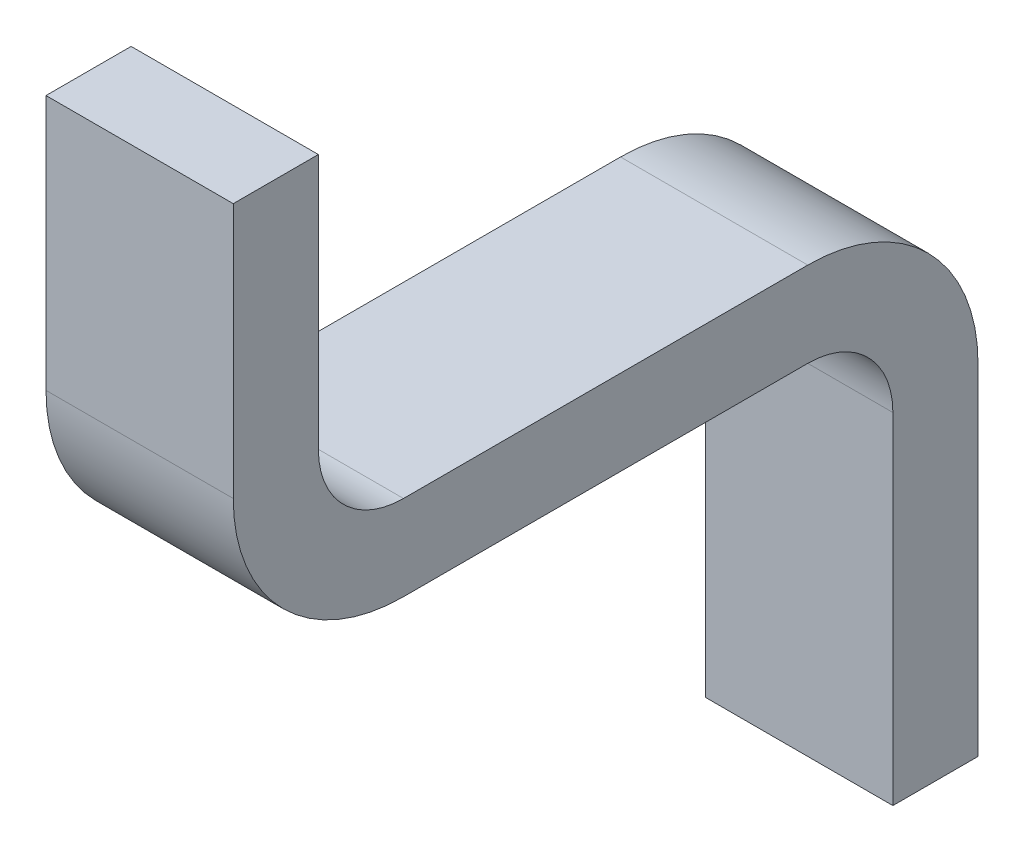
ISO-10303-21;
HEADER;
FILE_DESCRIPTION(('STEP AP214'),'2;1');
FILE_NAME('part.step','',(''),(''),'','','');
FILE_SCHEMA(('AUTOMOTIVE_DESIGN { 1 0 10303 214 1 1 1 1 }'));
ENDSEC;
DATA;
#1=APPLICATION_CONTEXT('core data for automotive mechanical design processes');
#2=APPLICATION_PROTOCOL_DEFINITION('international standard','automotive_design',2000,#1);
#3=PRODUCT_CONTEXT('',#1,'mechanical');
#4=PRODUCT('Part','Part','',(#3));
#5=PRODUCT_RELATED_PRODUCT_CATEGORY('part','',(#4));
#6=PRODUCT_DEFINITION_FORMATION('','',#4);
#7=PRODUCT_DEFINITION_CONTEXT('part definition',#1,'design');
#8=PRODUCT_DEFINITION('design','',#6,#7);
#9=PRODUCT_DEFINITION_SHAPE('','',#8);
#10=(LENGTH_UNIT() NAMED_UNIT(*) SI_UNIT(.MILLI.,.METRE.));
#11=(NAMED_UNIT(*) PLANE_ANGLE_UNIT() SI_UNIT($,.RADIAN.));
#12=(NAMED_UNIT(*) SI_UNIT($,.STERADIAN.) SOLID_ANGLE_UNIT());
#13=UNCERTAINTY_MEASURE_WITH_UNIT(LENGTH_MEASURE(1.E-05),#10,'distance_accuracy_value','');
#14=(GEOMETRIC_REPRESENTATION_CONTEXT(3) GLOBAL_UNCERTAINTY_ASSIGNED_CONTEXT((#13)) GLOBAL_UNIT_ASSIGNED_CONTEXT((#10,
#11,#12)) REPRESENTATION_CONTEXT('',''));
#15=CARTESIAN_POINT('',(0.,0.,0.));
#16=DIRECTION('',(0.,0.,1.));
#17=DIRECTION('',(1.,0.,0.));
#18=AXIS2_PLACEMENT_3D('',#15,#16,#17);
#19=CARTESIAN_POINT('',(-0.14,-3.9,0.675));
#20=DIRECTION('',(-1.,0.,0.));
#21=DIRECTION('',(0.,-1.,0.));
#22=AXIS2_PLACEMENT_3D('',#19,#20,#21);
#23=PLANE('',#22);
#24=CARTESIAN_POINT('',(-0.14,-3.8,0.675));
#25=DIRECTION('',(-1.,0.,0.));
#26=DIRECTION('',(0.,-1.,0.));
#27=AXIS2_PLACEMENT_3D('',#24,#25,#26);
#28=CIRCLE('',#27,0.1);
#29=CARTESIAN_POINT('',(-0.14,-3.9,0.675));
#30=VERTEX_POINT('',#29);
#31=CARTESIAN_POINT('',(-0.14,-3.8,0.775));
#32=VERTEX_POINT('',#31);
#33=EDGE_CURVE('E162',#30,#32,#28,.T.);
#34=ORIENTED_EDGE('',*,*,#33,.T.);
#35=DIRECTION('',(0.,1.,0.));
#36=VECTOR('',#35,1.);
#37=CARTESIAN_POINT('',(-0.14,-3.5,0.775));
#38=LINE('',#37,#36);
#39=CARTESIAN_POINT('',(-0.14,-3.5,0.775));
#40=VERTEX_POINT('',#39);
#41=EDGE_CURVE('E120',#32,#40,#38,.T.);
#42=ORIENTED_EDGE('',*,*,#41,.T.);
#43=DIRECTION('',(0.,0.,1.));
#44=VECTOR('',#43,1.);
#45=CARTESIAN_POINT('',(-0.14,-3.5,0.775));
#46=LINE('',#45,#44);
#47=CARTESIAN_POINT('',(-0.14,-3.5,0.875));
#48=VERTEX_POINT('',#47);
#49=EDGE_CURVE('E116',#48,#40,#46,.F.);
#50=ORIENTED_EDGE('',*,*,#49,.F.);
#51=DIRECTION('',(0.,1.,0.));
#52=VECTOR('',#51,1.);
#53=CARTESIAN_POINT('',(-0.14,-3.5,0.875));
#54=LINE('',#53,#52);
#55=CARTESIAN_POINT('',(-0.14,-3.8,0.875));
#56=VERTEX_POINT('',#55);
#57=EDGE_CURVE('E111',#48,#56,#54,.F.);
#58=ORIENTED_EDGE('',*,*,#57,.T.);
#59=CARTESIAN_POINT('',(-0.14,-3.8,0.675));
#60=DIRECTION('',(-1.,0.,0.));
#61=DIRECTION('',(0.,-1.,0.));
#62=AXIS2_PLACEMENT_3D('',#59,#60,#61);
#63=CIRCLE('',#62,0.2);
#64=CARTESIAN_POINT('',(-0.14,-4.,0.675));
#65=VERTEX_POINT('',#64);
#66=EDGE_CURVE('E102',#65,#56,#63,.T.);
#67=ORIENTED_EDGE('',*,*,#66,.F.);
#68=DIRECTION('',(0.,0.,1.));
#69=VECTOR('',#68,1.);
#70=CARTESIAN_POINT('',(-0.14,-4.,0.675));
#71=LINE('',#70,#69);
#72=CARTESIAN_POINT('',(-0.14,-4.,0.2));
#73=VERTEX_POINT('',#72);
#74=EDGE_CURVE('E98',#65,#73,#71,.F.);
#75=ORIENTED_EDGE('',*,*,#74,.T.);
#76=CARTESIAN_POINT('',(-0.14,-4.1,0.2));
#77=DIRECTION('',(1.,0.,0.));
#78=DIRECTION('',(0.,1.,0.));
#79=AXIS2_PLACEMENT_3D('',#76,#77,#78);
#80=CIRCLE('',#79,0.1);
#81=CARTESIAN_POINT('',(-0.14,-4.1,0.1));
#82=VERTEX_POINT('',#81);
#83=EDGE_CURVE('E20',#73,#82,#80,.F.);
#84=ORIENTED_EDGE('',*,*,#83,.T.);
#85=DIRECTION('',(0.,1.,0.));
#86=VECTOR('',#85,1.);
#87=CARTESIAN_POINT('',(-0.14,-4.1,0.1));
#88=LINE('',#87,#86);
#89=CARTESIAN_POINT('',(-0.14,-4.5,0.1));
#90=VERTEX_POINT('',#89);
#91=EDGE_CURVE('E145',#82,#90,#88,.F.);
#92=ORIENTED_EDGE('',*,*,#91,.T.);
#93=DIRECTION('',(0.,0.,1.));
#94=VECTOR('',#93,1.);
#95=CARTESIAN_POINT('',(-0.14,-4.5,0.));
#96=LINE('',#95,#94);
#97=CARTESIAN_POINT('',(-0.14,-4.5,0.));
#98=VERTEX_POINT('',#97);
#99=EDGE_CURVE('E139',#90,#98,#96,.F.);
#100=ORIENTED_EDGE('',*,*,#99,.T.);
#101=DIRECTION('',(0.,1.,0.));
#102=VECTOR('',#101,1.);
#103=CARTESIAN_POINT('',(-0.14,-4.1,0.));
#104=LINE('',#103,#102);
#105=CARTESIAN_POINT('',(-0.14,-4.1,0.));
#106=VERTEX_POINT('',#105);
#107=EDGE_CURVE('E132',#98,#106,#104,.T.);
#108=ORIENTED_EDGE('',*,*,#107,.T.);
#109=CARTESIAN_POINT('',(-0.14,-4.1,0.2));
#110=DIRECTION('',(1.,0.,0.));
#111=DIRECTION('',(0.,1.,0.));
#112=AXIS2_PLACEMENT_3D('',#109,#110,#111);
#113=CIRCLE('',#112,0.2);
#114=CARTESIAN_POINT('',(-0.14,-3.9,0.2));
#115=VERTEX_POINT('',#114);
#116=EDGE_CURVE('E135',#115,#106,#113,.F.);
#117=ORIENTED_EDGE('',*,*,#116,.F.);
#118=DIRECTION('',(0.,0.,1.));
#119=VECTOR('',#118,1.);
#120=CARTESIAN_POINT('',(-0.14,-3.9,0.675));
#121=LINE('',#120,#119);
#122=EDGE_CURVE('E128',#115,#30,#121,.T.);
#123=ORIENTED_EDGE('',*,*,#122,.T.);
#124=EDGE_LOOP('',(#34,#42,#50,#58,#67,#75,#84,#92,#100,#108,#117,#123));
#125=FACE_BOUND('',#124,.T.);
#126=ADVANCED_FACE('F17',(#125),#23,.F.);
#127=CARTESIAN_POINT('',(-0.14,-4.1,0.2));
#128=DIRECTION('',(1.,0.,0.));
#129=DIRECTION('',(0.,1.,0.));
#130=AXIS2_PLACEMENT_3D('',#127,#128,#129);
#131=CYLINDRICAL_SURFACE('',#130,0.1);
#132=DIRECTION('',(-1.,0.,0.));
#133=VECTOR('',#132,1.);
#134=CARTESIAN_POINT('',(-0.14,-4.,0.2));
#135=LINE('',#134,#133);
#136=CARTESIAN_POINT('',(-0.36,-4.,0.2));
#137=VERTEX_POINT('',#136);
#138=EDGE_CURVE('E91',#73,#137,#135,.T.);
#139=ORIENTED_EDGE('',*,*,#138,.T.);
#140=CARTESIAN_POINT('',(-0.36,-4.1,0.2));
#141=DIRECTION('',(1.,0.,0.));
#142=DIRECTION('',(0.,1.,0.));
#143=AXIS2_PLACEMENT_3D('',#140,#141,#142);
#144=CIRCLE('',#143,0.1);
#145=CARTESIAN_POINT('',(-0.36,-4.1,0.1));
#146=VERTEX_POINT('',#145);
#147=EDGE_CURVE('E103',#137,#146,#144,.F.);
#148=ORIENTED_EDGE('',*,*,#147,.T.);
#149=DIRECTION('',(-1.,0.,0.));
#150=VECTOR('',#149,1.);
#151=CARTESIAN_POINT('',(-0.14,-4.1,0.1));
#152=LINE('',#151,#150);
#153=EDGE_CURVE('E92',#146,#82,#152,.F.);
#154=ORIENTED_EDGE('',*,*,#153,.T.);
#155=ORIENTED_EDGE('',*,*,#83,.F.);
#156=EDGE_LOOP('',(#139,#148,#154,#155));
#157=FACE_BOUND('',#156,.T.);
#158=ADVANCED_FACE('F89',(#157),#131,.F.);
#159=CARTESIAN_POINT('',(-0.14,-4.1,0.1));
#160=DIRECTION('',(0.,0.,-1.));
#161=DIRECTION('',(-1.,0.,0.));
#162=AXIS2_PLACEMENT_3D('',#159,#160,#161);
#163=PLANE('',#162);
#164=ORIENTED_EDGE('',*,*,#153,.F.);
#165=DIRECTION('',(0.,1.,0.));
#166=VECTOR('',#165,1.);
#167=CARTESIAN_POINT('',(-0.36,-4.,0.1));
#168=LINE('',#167,#166);
#169=CARTESIAN_POINT('',(-0.36,-4.5,0.1));
#170=VERTEX_POINT('',#169);
#171=EDGE_CURVE('E105',#146,#170,#168,.F.);
#172=ORIENTED_EDGE('',*,*,#171,.T.);
#173=DIRECTION('',(-1.,0.,0.));
#174=VECTOR('',#173,1.);
#175=CARTESIAN_POINT('',(-0.36,-4.5,0.1));
#176=LINE('',#175,#174);
#177=EDGE_CURVE('E142',#170,#90,#176,.F.);
#178=ORIENTED_EDGE('',*,*,#177,.T.);
#179=ORIENTED_EDGE('',*,*,#91,.F.);
#180=EDGE_LOOP('',(#164,#172,#178,#179));
#181=FACE_BOUND('',#180,.T.);
#182=ADVANCED_FACE('F187',(#181),#163,.F.);
#183=CARTESIAN_POINT('',(-0.36,-4.5,0.));
#184=DIRECTION('',(0.,1.,0.));
#185=DIRECTION('',(-1.,0.,0.));
#186=AXIS2_PLACEMENT_3D('',#183,#184,#185);
#187=PLANE('',#186);
#188=ORIENTED_EDGE('',*,*,#177,.F.);
#189=DIRECTION('',(0.,0.,1.));
#190=VECTOR('',#189,1.);
#191=CARTESIAN_POINT('',(-0.36,-4.5,0.675));
#192=LINE('',#191,#190);
#193=CARTESIAN_POINT('',(-0.36,-4.5,0.));
#194=VERTEX_POINT('',#193);
#195=EDGE_CURVE('E176',#170,#194,#192,.F.);
#196=ORIENTED_EDGE('',*,*,#195,.T.);
#197=DIRECTION('',(1.,0.,0.));
#198=VECTOR('',#197,1.);
#199=CARTESIAN_POINT('',(-0.36,-4.5,0.));
#200=LINE('',#199,#198);
#201=EDGE_CURVE('E136',#194,#98,#200,.T.);
#202=ORIENTED_EDGE('',*,*,#201,.T.);
#203=ORIENTED_EDGE('',*,*,#99,.F.);
#204=EDGE_LOOP('',(#188,#196,#202,#203));
#205=FACE_BOUND('',#204,.T.);
#206=ADVANCED_FACE('F192',(#205),#187,.F.);
#207=CARTESIAN_POINT('',(-0.36,-4.1,0.));
#208=DIRECTION('',(0.,0.,1.));
#209=DIRECTION('',(1.,0.,0.));
#210=AXIS2_PLACEMENT_3D('',#207,#208,#209);
#211=PLANE('',#210);
#212=DIRECTION('',(1.,0.,0.));
#213=VECTOR('',#212,1.);
#214=CARTESIAN_POINT('',(-0.36,-4.1,0.));
#215=LINE('',#214,#213);
#216=CARTESIAN_POINT('',(-0.36,-4.1,0.));
#217=VERTEX_POINT('',#216);
#218=EDGE_CURVE('E163',#106,#217,#215,.F.);
#219=ORIENTED_EDGE('',*,*,#218,.F.);
#220=ORIENTED_EDGE('',*,*,#107,.F.);
#221=ORIENTED_EDGE('',*,*,#201,.F.);
#222=DIRECTION('',(0.,1.,0.));
#223=VECTOR('',#222,1.);
#224=CARTESIAN_POINT('',(-0.36,-4.,0.));
#225=LINE('',#224,#223);
#226=EDGE_CURVE('E159',#194,#217,#225,.T.);
#227=ORIENTED_EDGE('',*,*,#226,.T.);
#228=EDGE_LOOP('',(#219,#220,#221,#227));
#229=FACE_BOUND('',#228,.T.);
#230=ADVANCED_FACE('F264',(#229),#211,.F.);
#231=CARTESIAN_POINT('',(-0.36,-4.1,0.2));
#232=DIRECTION('',(1.,0.,0.));
#233=DIRECTION('',(0.,1.,0.));
#234=AXIS2_PLACEMENT_3D('',#231,#232,#233);
#235=CYLINDRICAL_SURFACE('',#234,0.2);
#236=ORIENTED_EDGE('',*,*,#116,.T.);
#237=ORIENTED_EDGE('',*,*,#218,.T.);
#238=CARTESIAN_POINT('',(-0.36,-4.1,0.2));
#239=DIRECTION('',(1.,0.,0.));
#240=DIRECTION('',(0.,1.,0.));
#241=AXIS2_PLACEMENT_3D('',#238,#239,#240);
#242=CIRCLE('',#241,0.2);
#243=CARTESIAN_POINT('',(-0.36,-3.9,0.2));
#244=VERTEX_POINT('',#243);
#245=EDGE_CURVE('E157',#217,#244,#242,.T.);
#246=ORIENTED_EDGE('',*,*,#245,.T.);
#247=DIRECTION('',(1.,0.,0.));
#248=VECTOR('',#247,1.);
#249=CARTESIAN_POINT('',(-0.36,-3.9,0.2));
#250=LINE('',#249,#248);
#251=EDGE_CURVE('E131',#244,#115,#250,.T.);
#252=ORIENTED_EDGE('',*,*,#251,.T.);
#253=EDGE_LOOP('',(#236,#237,#246,#252));
#254=FACE_BOUND('',#253,.T.);
#255=ADVANCED_FACE('F266',(#254),#235,.T.);
#256=CARTESIAN_POINT('',(-0.36,-3.9,0.675));
#257=DIRECTION('',(0.,-1.,0.));
#258=DIRECTION('',(1.,0.,0.));
#259=AXIS2_PLACEMENT_3D('',#256,#257,#258);
#260=PLANE('',#259);
#261=DIRECTION('',(-1.,0.,0.));
#262=VECTOR('',#261,1.);
#263=CARTESIAN_POINT('',(-0.36,-3.9,0.675));
#264=LINE('',#263,#262);
#265=CARTESIAN_POINT('',(-0.36,-3.9,0.675));
#266=VERTEX_POINT('',#265);
#267=EDGE_CURVE('E130',#266,#30,#264,.F.);
#268=ORIENTED_EDGE('',*,*,#267,.T.);
#269=ORIENTED_EDGE('',*,*,#122,.F.);
#270=ORIENTED_EDGE('',*,*,#251,.F.);
#271=DIRECTION('',(0.,0.,1.));
#272=VECTOR('',#271,1.);
#273=CARTESIAN_POINT('',(-0.36,-3.9,0.675));
#274=LINE('',#273,#272);
#275=EDGE_CURVE('E156',#244,#266,#274,.T.);
#276=ORIENTED_EDGE('',*,*,#275,.T.);
#277=EDGE_LOOP('',(#268,#269,#270,#276));
#278=FACE_BOUND('',#277,.T.);
#279=ADVANCED_FACE('F231',(#278),#260,.F.);
#280=CARTESIAN_POINT('',(-0.36,-3.8,0.675));
#281=DIRECTION('',(-1.,0.,0.));
#282=DIRECTION('',(0.,-1.,0.));
#283=AXIS2_PLACEMENT_3D('',#280,#281,#282);
#284=CYLINDRICAL_SURFACE('',#283,0.1);
#285=DIRECTION('',(1.,0.,0.));
#286=VECTOR('',#285,1.);
#287=CARTESIAN_POINT('',(-0.36,-3.8,0.775));
#288=LINE('',#287,#286);
#289=CARTESIAN_POINT('',(-0.36,-3.8,0.775));
#290=VERTEX_POINT('',#289);
#291=EDGE_CURVE('E125',#290,#32,#288,.T.);
#292=ORIENTED_EDGE('',*,*,#291,.T.);
#293=ORIENTED_EDGE('',*,*,#33,.F.);
#294=ORIENTED_EDGE('',*,*,#267,.F.);
#295=CARTESIAN_POINT('',(-0.36,-3.8,0.675));
#296=DIRECTION('',(-1.,0.,0.));
#297=DIRECTION('',(0.,-1.,0.));
#298=AXIS2_PLACEMENT_3D('',#295,#296,#297);
#299=CIRCLE('',#298,0.1);
#300=EDGE_CURVE('E152',#266,#290,#299,.T.);
#301=ORIENTED_EDGE('',*,*,#300,.T.);
#302=EDGE_LOOP('',(#292,#293,#294,#301));
#303=FACE_BOUND('',#302,.T.);
#304=ADVANCED_FACE('F235',(#303),#284,.F.);
#305=CARTESIAN_POINT('',(-0.36,-3.5,0.775));
#306=DIRECTION('',(0.,0.,1.));
#307=DIRECTION('',(1.,0.,0.));
#308=AXIS2_PLACEMENT_3D('',#305,#306,#307);
#309=PLANE('',#308);
#310=DIRECTION('',(-1.,0.,0.));
#311=VECTOR('',#310,1.);
#312=CARTESIAN_POINT('',(-0.36,-3.5,0.775));
#313=LINE('',#312,#311);
#314=CARTESIAN_POINT('',(-0.36,-3.5,0.775));
#315=VERTEX_POINT('',#314);
#316=EDGE_CURVE('E119',#40,#315,#313,.T.);
#317=ORIENTED_EDGE('',*,*,#316,.F.);
#318=ORIENTED_EDGE('',*,*,#41,.F.);
#319=ORIENTED_EDGE('',*,*,#291,.F.);
#320=DIRECTION('',(0.,1.,0.));
#321=VECTOR('',#320,1.);
#322=CARTESIAN_POINT('',(-0.36,-4.,0.775));
#323=LINE('',#322,#321);
#324=EDGE_CURVE('E155',#290,#315,#323,.T.);
#325=ORIENTED_EDGE('',*,*,#324,.T.);
#326=EDGE_LOOP('',(#317,#318,#319,#325));
#327=FACE_BOUND('',#326,.T.);
#328=ADVANCED_FACE('F259',(#327),#309,.F.);
#329=CARTESIAN_POINT('',(-0.36,-3.5,0.775));
#330=DIRECTION('',(0.,1.,0.));
#331=DIRECTION('',(-1.,0.,0.));
#332=AXIS2_PLACEMENT_3D('',#329,#330,#331);
#333=PLANE('',#332);
#334=DIRECTION('',(0.,0.,1.));
#335=VECTOR('',#334,1.);
#336=CARTESIAN_POINT('',(-0.36,-3.5,0.675));
#337=LINE('',#336,#335);
#338=CARTESIAN_POINT('',(-0.36,-3.5,0.875));
#339=VERTEX_POINT('',#338);
#340=EDGE_CURVE('E217',#315,#339,#337,.T.);
#341=ORIENTED_EDGE('',*,*,#340,.T.);
#342=DIRECTION('',(-1.,0.,0.));
#343=VECTOR('',#342,1.);
#344=CARTESIAN_POINT('',(-0.14,-3.5,0.875));
#345=LINE('',#344,#343);
#346=EDGE_CURVE('E113',#339,#48,#345,.F.);
#347=ORIENTED_EDGE('',*,*,#346,.T.);
#348=ORIENTED_EDGE('',*,*,#49,.T.);
#349=ORIENTED_EDGE('',*,*,#316,.T.);
#350=EDGE_LOOP('',(#341,#347,#348,#349));
#351=FACE_BOUND('',#350,.T.);
#352=ADVANCED_FACE('F255',(#351),#333,.T.);
#353=CARTESIAN_POINT('',(-0.14,-3.5,0.875));
#354=DIRECTION('',(0.,0.,-1.));
#355=DIRECTION('',(-1.,0.,0.));
#356=AXIS2_PLACEMENT_3D('',#353,#354,#355);
#357=PLANE('',#356);
#358=ORIENTED_EDGE('',*,*,#346,.F.);
#359=DIRECTION('',(0.,1.,0.));
#360=VECTOR('',#359,1.);
#361=CARTESIAN_POINT('',(-0.36,-4.,0.875));
#362=LINE('',#361,#360);
#363=CARTESIAN_POINT('',(-0.36,-3.8,0.875));
#364=VERTEX_POINT('',#363);
#365=EDGE_CURVE('E151',#339,#364,#362,.F.);
#366=ORIENTED_EDGE('',*,*,#365,.T.);
#367=DIRECTION('',(-1.,0.,0.));
#368=VECTOR('',#367,1.);
#369=CARTESIAN_POINT('',(-0.14,-3.8,0.875));
#370=LINE('',#369,#368);
#371=EDGE_CURVE('E99',#56,#364,#370,.T.);
#372=ORIENTED_EDGE('',*,*,#371,.F.);
#373=ORIENTED_EDGE('',*,*,#57,.F.);
#374=EDGE_LOOP('',(#358,#366,#372,#373));
#375=FACE_BOUND('',#374,.T.);
#376=ADVANCED_FACE('F251',(#375),#357,.F.);
#377=CARTESIAN_POINT('',(-0.14,-3.8,0.675));
#378=DIRECTION('',(-1.,0.,0.));
#379=DIRECTION('',(0.,-1.,0.));
#380=AXIS2_PLACEMENT_3D('',#377,#378,#379);
#381=CYLINDRICAL_SURFACE('',#380,0.2);
#382=CARTESIAN_POINT('',(-0.36,-3.8,0.675));
#383=DIRECTION('',(-1.,0.,0.));
#384=DIRECTION('',(0.,-1.,0.));
#385=AXIS2_PLACEMENT_3D('',#382,#383,#384);
#386=CIRCLE('',#385,0.2);
#387=CARTESIAN_POINT('',(-0.36,-4.,0.675));
#388=VERTEX_POINT('',#387);
#389=EDGE_CURVE('E26',#364,#388,#386,.F.);
#390=ORIENTED_EDGE('',*,*,#389,.T.);
#391=DIRECTION('',(-1.,0.,0.));
#392=VECTOR('',#391,1.);
#393=CARTESIAN_POINT('',(-0.14,-4.,0.675));
#394=LINE('',#393,#392);
#395=EDGE_CURVE('E34',#388,#65,#394,.F.);
#396=ORIENTED_EDGE('',*,*,#395,.T.);
#397=ORIENTED_EDGE('',*,*,#66,.T.);
#398=ORIENTED_EDGE('',*,*,#371,.T.);
#399=EDGE_LOOP('',(#390,#396,#397,#398));
#400=FACE_BOUND('',#399,.T.);
#401=ADVANCED_FACE('F280',(#400),#381,.T.);
#402=CARTESIAN_POINT('',(-0.14,-4.,0.675));
#403=DIRECTION('',(0.,1.,0.));
#404=DIRECTION('',(-1.,0.,0.));
#405=AXIS2_PLACEMENT_3D('',#402,#403,#404);
#406=PLANE('',#405);
#407=ORIENTED_EDGE('',*,*,#395,.F.);
#408=DIRECTION('',(0.,0.,1.));
#409=VECTOR('',#408,1.);
#410=CARTESIAN_POINT('',(-0.36,-4.,0.675));
#411=LINE('',#410,#409);
#412=EDGE_CURVE('E11',#388,#137,#411,.F.);
#413=ORIENTED_EDGE('',*,*,#412,.T.);
#414=ORIENTED_EDGE('',*,*,#138,.F.);
#415=ORIENTED_EDGE('',*,*,#74,.F.);
#416=EDGE_LOOP('',(#407,#413,#414,#415));
#417=FACE_BOUND('',#416,.T.);
#418=ADVANCED_FACE('F97',(#417),#406,.F.);
#419=CARTESIAN_POINT('',(-0.36,-4.,0.675));
#420=DIRECTION('',(1.,0.,0.));
#421=DIRECTION('',(0.,1.,0.));
#422=AXIS2_PLACEMENT_3D('',#419,#420,#421);
#423=PLANE('',#422);
#424=ORIENTED_EDGE('',*,*,#389,.F.);
#425=ORIENTED_EDGE('',*,*,#365,.F.);
#426=ORIENTED_EDGE('',*,*,#340,.F.);
#427=ORIENTED_EDGE('',*,*,#324,.F.);
#428=ORIENTED_EDGE('',*,*,#300,.F.);
#429=ORIENTED_EDGE('',*,*,#275,.F.);
#430=ORIENTED_EDGE('',*,*,#245,.F.);
#431=ORIENTED_EDGE('',*,*,#226,.F.);
#432=ORIENTED_EDGE('',*,*,#195,.F.);
#433=ORIENTED_EDGE('',*,*,#171,.F.);
#434=ORIENTED_EDGE('',*,*,#147,.F.);
#435=ORIENTED_EDGE('',*,*,#412,.F.);
#436=EDGE_LOOP('',(#424,#425,#426,#427,#428,#429,#430,#431,#432,#433,#434,#435));
#437=FACE_BOUND('',#436,.T.);
#438=ADVANCED_FACE('F197',(#437),#423,.F.);
#439=CLOSED_SHELL('',(#126,#158,#182,#206,#230,#255,#279,#304,#328,#352,#376,#401,#418,#438));
#440=MANIFOLD_SOLID_BREP('B1',#439);
#441=ADVANCED_BREP_SHAPE_REPRESENTATION('',(#18,#440),#14);
#442=SHAPE_DEFINITION_REPRESENTATION(#9,#441);
ENDSEC;
END-ISO-10303-21;
